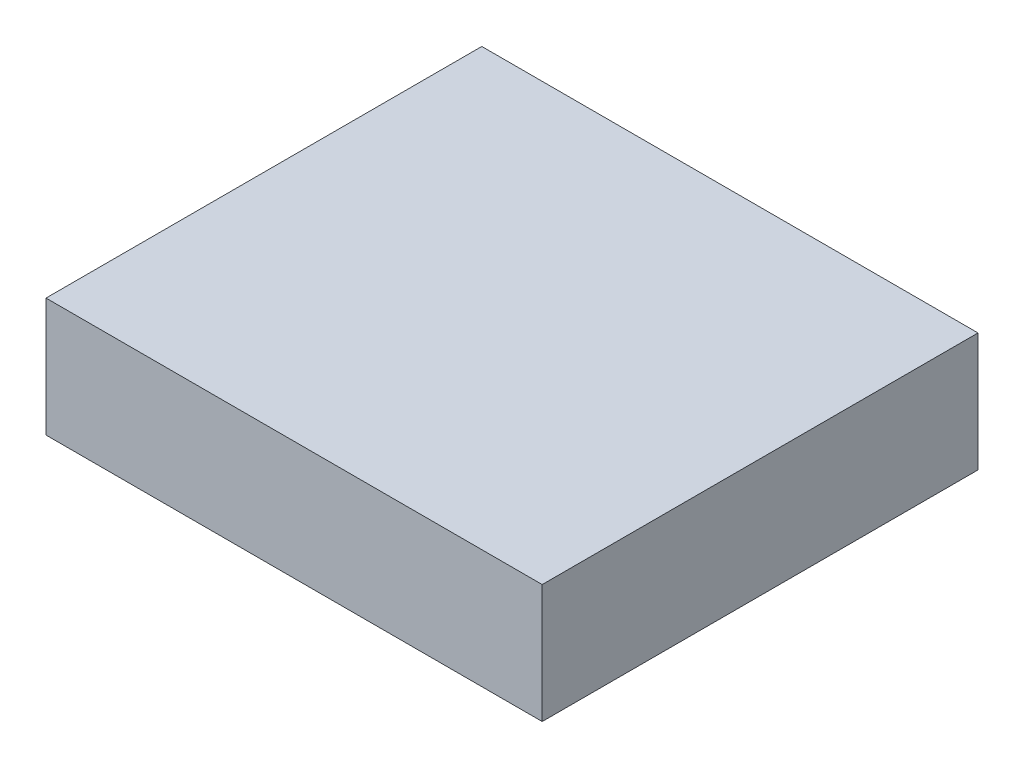
ISO-10303-21;
HEADER;
FILE_DESCRIPTION(('STEP AP214'),'2;1');
FILE_NAME('part.step','',(''),(''),'','','');
FILE_SCHEMA(('AUTOMOTIVE_DESIGN { 1 0 10303 214 1 1 1 1 }'));
ENDSEC;
DATA;
#1=APPLICATION_CONTEXT('core data for automotive mechanical design processes');
#2=APPLICATION_PROTOCOL_DEFINITION('international standard','automotive_design',2000,#1);
#3=PRODUCT_CONTEXT('',#1,'mechanical');
#4=PRODUCT('Part','Part','',(#3));
#5=PRODUCT_RELATED_PRODUCT_CATEGORY('part','',(#4));
#6=PRODUCT_DEFINITION_FORMATION('','',#4);
#7=PRODUCT_DEFINITION_CONTEXT('part definition',#1,'design');
#8=PRODUCT_DEFINITION('design','',#6,#7);
#9=PRODUCT_DEFINITION_SHAPE('','',#8);
#10=(LENGTH_UNIT() NAMED_UNIT(*) SI_UNIT(.MILLI.,.METRE.));
#11=(NAMED_UNIT(*) PLANE_ANGLE_UNIT() SI_UNIT($,.RADIAN.));
#12=(NAMED_UNIT(*) SI_UNIT($,.STERADIAN.) SOLID_ANGLE_UNIT());
#13=UNCERTAINTY_MEASURE_WITH_UNIT(LENGTH_MEASURE(1.E-05),#10,'distance_accuracy_value','');
#14=(GEOMETRIC_REPRESENTATION_CONTEXT(3) GLOBAL_UNCERTAINTY_ASSIGNED_CONTEXT((#13)) GLOBAL_UNIT_ASSIGNED_CONTEXT((#10,
#11,#12)) REPRESENTATION_CONTEXT('',''));
#15=CARTESIAN_POINT('',(0.,0.,0.));
#16=DIRECTION('',(0.,0.,1.));
#17=DIRECTION('',(1.,0.,0.));
#18=AXIS2_PLACEMENT_3D('',#15,#16,#17);
#19=CARTESIAN_POINT('',(57.5,27.5,50.5));
#20=DIRECTION('',(-1.,0.,0.));
#21=DIRECTION('',(0.,0.,1.));
#22=AXIS2_PLACEMENT_3D('',#19,#20,#21);
#23=PLANE('',#22);
#24=DIRECTION('',(0.,0.,-1.));
#25=VECTOR('',#24,1.);
#26=CARTESIAN_POINT('',(57.5,0.,50.5));
#27=LINE('',#26,#25);
#28=CARTESIAN_POINT('',(57.5,0.,50.5));
#29=VERTEX_POINT('',#28);
#30=CARTESIAN_POINT('',(57.5,0.,-50.5));
#31=VERTEX_POINT('',#30);
#32=EDGE_CURVE('E97',#29,#31,#27,.T.);
#33=ORIENTED_EDGE('',*,*,#32,.T.);
#34=DIRECTION('',(0.,-1.,0.));
#35=VECTOR('',#34,1.);
#36=CARTESIAN_POINT('',(57.5,27.5,-50.5));
#37=LINE('',#36,#35);
#38=CARTESIAN_POINT('',(57.5,27.5,-50.5));
#39=VERTEX_POINT('',#38);
#40=EDGE_CURVE('E11',#39,#31,#37,.T.);
#41=ORIENTED_EDGE('',*,*,#40,.F.);
#42=DIRECTION('',(0.,0.,-1.));
#43=VECTOR('',#42,1.);
#44=CARTESIAN_POINT('',(57.5,27.5,50.5));
#45=LINE('',#44,#43);
#46=CARTESIAN_POINT('',(57.5,27.5,50.5));
#47=VERTEX_POINT('',#46);
#48=EDGE_CURVE('E85',#47,#39,#45,.T.);
#49=ORIENTED_EDGE('',*,*,#48,.F.);
#50=DIRECTION('',(0.,-1.,0.));
#51=VECTOR('',#50,1.);
#52=CARTESIAN_POINT('',(57.5,27.5,50.5));
#53=LINE('',#52,#51);
#54=EDGE_CURVE('E93',#47,#29,#53,.T.);
#55=ORIENTED_EDGE('',*,*,#54,.T.);
#56=EDGE_LOOP('',(#33,#41,#49,#55));
#57=FACE_BOUND('',#56,.T.);
#58=ADVANCED_FACE('F34',(#57),#23,.F.);
#59=CARTESIAN_POINT('',(-57.5,27.5,-50.5));
#60=DIRECTION('',(0.,0.,1.));
#61=DIRECTION('',(1.,0.,0.));
#62=AXIS2_PLACEMENT_3D('',#59,#60,#61);
#63=PLANE('',#62);
#64=DIRECTION('',(-1.,0.,0.));
#65=VECTOR('',#64,1.);
#66=CARTESIAN_POINT('',(-57.5,0.,-50.5));
#67=LINE('',#66,#65);
#68=CARTESIAN_POINT('',(-57.5,0.,-50.5));
#69=VERTEX_POINT('',#68);
#70=EDGE_CURVE('E89',#31,#69,#67,.T.);
#71=ORIENTED_EDGE('',*,*,#70,.T.);
#72=DIRECTION('',(0.,-1.,0.));
#73=VECTOR('',#72,1.);
#74=CARTESIAN_POINT('',(-57.5,27.5,-50.5));
#75=LINE('',#74,#73);
#76=CARTESIAN_POINT('',(-57.5,27.5,-50.5));
#77=VERTEX_POINT('',#76);
#78=EDGE_CURVE('E42',#77,#69,#75,.T.);
#79=ORIENTED_EDGE('',*,*,#78,.F.);
#80=DIRECTION('',(-1.,0.,0.));
#81=VECTOR('',#80,1.);
#82=CARTESIAN_POINT('',(-57.5,27.5,-50.5));
#83=LINE('',#82,#81);
#84=EDGE_CURVE('E80',#39,#77,#83,.T.);
#85=ORIENTED_EDGE('',*,*,#84,.F.);
#86=ORIENTED_EDGE('',*,*,#40,.T.);
#87=EDGE_LOOP('',(#71,#79,#85,#86));
#88=FACE_BOUND('',#87,.T.);
#89=ADVANCED_FACE('F88',(#88),#63,.F.);
#90=CARTESIAN_POINT('',(-57.5,27.5,50.5));
#91=DIRECTION('',(1.,0.,0.));
#92=DIRECTION('',(0.,0.,-1.));
#93=AXIS2_PLACEMENT_3D('',#90,#91,#92);
#94=PLANE('',#93);
#95=DIRECTION('',(0.,0.,1.));
#96=VECTOR('',#95,1.);
#97=CARTESIAN_POINT('',(-57.5,0.,50.5));
#98=LINE('',#97,#96);
#99=CARTESIAN_POINT('',(-57.5,0.,50.5));
#100=VERTEX_POINT('',#99);
#101=EDGE_CURVE('E67',#69,#100,#98,.T.);
#102=ORIENTED_EDGE('',*,*,#101,.T.);
#103=DIRECTION('',(0.,-1.,0.));
#104=VECTOR('',#103,1.);
#105=CARTESIAN_POINT('',(-57.5,27.5,50.5));
#106=LINE('',#105,#104);
#107=CARTESIAN_POINT('',(-57.5,27.5,50.5));
#108=VERTEX_POINT('',#107);
#109=EDGE_CURVE('E90',#108,#100,#106,.T.);
#110=ORIENTED_EDGE('',*,*,#109,.F.);
#111=DIRECTION('',(0.,0.,1.));
#112=VECTOR('',#111,1.);
#113=CARTESIAN_POINT('',(-57.5,27.5,50.5));
#114=LINE('',#113,#112);
#115=EDGE_CURVE('E83',#77,#108,#114,.T.);
#116=ORIENTED_EDGE('',*,*,#115,.F.);
#117=ORIENTED_EDGE('',*,*,#78,.T.);
#118=EDGE_LOOP('',(#102,#110,#116,#117));
#119=FACE_BOUND('',#118,.T.);
#120=ADVANCED_FACE('F91',(#119),#94,.F.);
#121=CARTESIAN_POINT('',(-57.5,27.5,50.5));
#122=DIRECTION('',(0.,0.,-1.));
#123=DIRECTION('',(-1.,0.,0.));
#124=AXIS2_PLACEMENT_3D('',#121,#122,#123);
#125=PLANE('',#124);
#126=DIRECTION('',(1.,0.,0.));
#127=VECTOR('',#126,1.);
#128=CARTESIAN_POINT('',(-57.5,0.,50.5));
#129=LINE('',#128,#127);
#130=EDGE_CURVE('E73',#100,#29,#129,.T.);
#131=ORIENTED_EDGE('',*,*,#130,.T.);
#132=ORIENTED_EDGE('',*,*,#54,.F.);
#133=DIRECTION('',(1.,0.,0.));
#134=VECTOR('',#133,1.);
#135=CARTESIAN_POINT('',(-57.5,27.5,50.5));
#136=LINE('',#135,#134);
#137=EDGE_CURVE('E50',#108,#47,#136,.T.);
#138=ORIENTED_EDGE('',*,*,#137,.F.);
#139=ORIENTED_EDGE('',*,*,#109,.T.);
#140=EDGE_LOOP('',(#131,#132,#138,#139));
#141=FACE_BOUND('',#140,.T.);
#142=ADVANCED_FACE('F104',(#141),#125,.F.);
#143=CARTESIAN_POINT('',(0.,27.5,0.));
#144=DIRECTION('',(0.,-1.,0.));
#145=DIRECTION('',(0.,0.,-1.));
#146=AXIS2_PLACEMENT_3D('',#143,#144,#145);
#147=PLANE('',#146);
#148=ORIENTED_EDGE('',*,*,#48,.T.);
#149=ORIENTED_EDGE('',*,*,#84,.T.);
#150=ORIENTED_EDGE('',*,*,#115,.T.);
#151=ORIENTED_EDGE('',*,*,#137,.T.);
#152=EDGE_LOOP('',(#148,#149,#150,#151));
#153=FACE_BOUND('',#152,.T.);
#154=ADVANCED_FACE('F81',(#153),#147,.F.);
#155=CARTESIAN_POINT('',(0.,0.,0.));
#156=DIRECTION('',(0.,-1.,0.));
#157=DIRECTION('',(0.,0.,-1.));
#158=AXIS2_PLACEMENT_3D('',#155,#156,#157);
#159=PLANE('',#158);
#160=ORIENTED_EDGE('',*,*,#32,.F.);
#161=ORIENTED_EDGE('',*,*,#130,.F.);
#162=ORIENTED_EDGE('',*,*,#101,.F.);
#163=ORIENTED_EDGE('',*,*,#70,.F.);
#164=EDGE_LOOP('',(#160,#161,#162,#163));
#165=FACE_BOUND('',#164,.T.);
#166=ADVANCED_FACE('F107',(#165),#159,.T.);
#167=CLOSED_SHELL('',(#58,#89,#120,#142,#154,#166));
#168=MANIFOLD_SOLID_BREP('B2',#167);
#169=ADVANCED_BREP_SHAPE_REPRESENTATION('',(#18,#168),#14);
#170=SHAPE_DEFINITION_REPRESENTATION(#9,#169);
ENDSEC;
END-ISO-10303-21;
